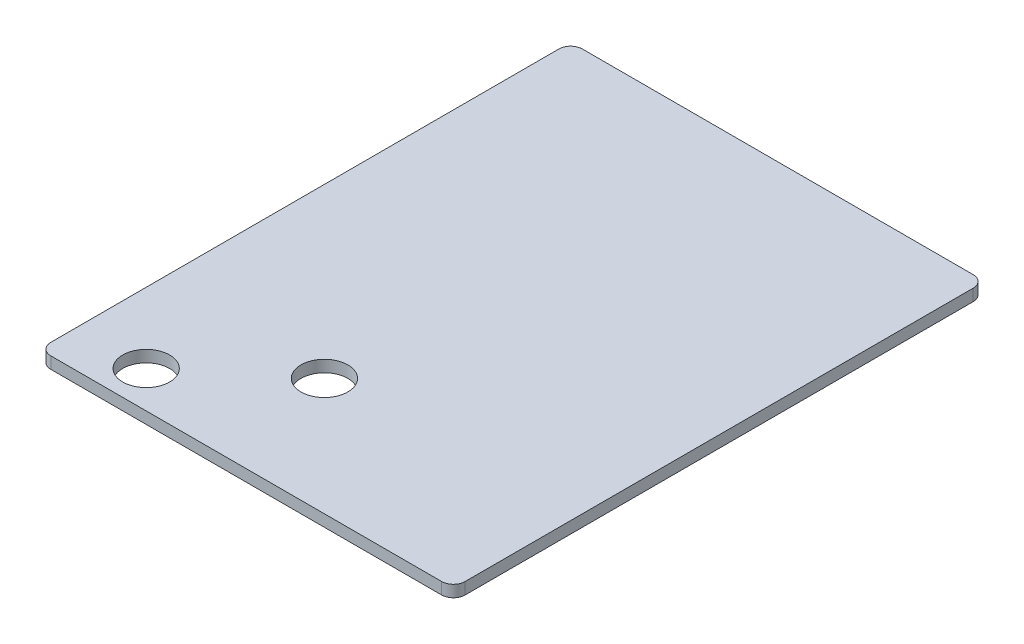
ISO-10303-21;
HEADER;
FILE_DESCRIPTION(('STEP AP214'),'2;1');
FILE_NAME('part.step','',(''),(''),'','','');
FILE_SCHEMA(('AUTOMOTIVE_DESIGN { 1 0 10303 214 1 1 1 1 }'));
ENDSEC;
DATA;
#1=APPLICATION_CONTEXT('core data for automotive mechanical design processes');
#2=APPLICATION_PROTOCOL_DEFINITION('international standard','automotive_design',2000,#1);
#3=PRODUCT_CONTEXT('',#1,'mechanical');
#4=PRODUCT('Part','Part','',(#3));
#5=PRODUCT_RELATED_PRODUCT_CATEGORY('part','',(#4));
#6=PRODUCT_DEFINITION_FORMATION('','',#4);
#7=PRODUCT_DEFINITION_CONTEXT('part definition',#1,'design');
#8=PRODUCT_DEFINITION('design','',#6,#7);
#9=PRODUCT_DEFINITION_SHAPE('','',#8);
#10=(LENGTH_UNIT() NAMED_UNIT(*) SI_UNIT(.MILLI.,.METRE.));
#11=(NAMED_UNIT(*) PLANE_ANGLE_UNIT() SI_UNIT($,.RADIAN.));
#12=(NAMED_UNIT(*) SI_UNIT($,.STERADIAN.) SOLID_ANGLE_UNIT());
#13=UNCERTAINTY_MEASURE_WITH_UNIT(LENGTH_MEASURE(1.E-05),#10,'distance_accuracy_value','');
#14=(GEOMETRIC_REPRESENTATION_CONTEXT(3) GLOBAL_UNCERTAINTY_ASSIGNED_CONTEXT((#13)) GLOBAL_UNIT_ASSIGNED_CONTEXT((#10,
#11,#12)) REPRESENTATION_CONTEXT('',''));
#15=CARTESIAN_POINT('',(0.,0.,0.));
#16=DIRECTION('',(0.,0.,1.));
#17=DIRECTION('',(1.,0.,0.));
#18=AXIS2_PLACEMENT_3D('',#15,#16,#17);
#19=CARTESIAN_POINT('',(53.,3.,68.));
#20=DIRECTION('',(-1.,0.,0.));
#21=DIRECTION('',(0.,0.,1.));
#22=AXIS2_PLACEMENT_3D('',#19,#20,#21);
#23=PLANE('',#22);
#24=DIRECTION('',(0.,0.,-1.));
#25=VECTOR('',#24,1.);
#26=CARTESIAN_POINT('',(53.,3.,68.));
#27=LINE('',#26,#25);
#28=CARTESIAN_POINT('',(53.,3.,65.));
#29=VERTEX_POINT('',#28);
#30=CARTESIAN_POINT('',(53.,3.,-65.));
#31=VERTEX_POINT('',#30);
#32=EDGE_CURVE('E127',#29,#31,#27,.T.);
#33=ORIENTED_EDGE('',*,*,#32,.F.);
#34=DIRECTION('',(0.,-1.,0.));
#35=VECTOR('',#34,1.);
#36=CARTESIAN_POINT('',(53.,3.,65.));
#37=LINE('',#36,#35);
#38=CARTESIAN_POINT('',(53.,0.,65.));
#39=VERTEX_POINT('',#38);
#40=EDGE_CURVE('E111',#29,#39,#37,.T.);
#41=ORIENTED_EDGE('',*,*,#40,.T.);
#42=DIRECTION('',(0.,0.,-1.));
#43=VECTOR('',#42,1.);
#44=CARTESIAN_POINT('',(53.,0.,68.));
#45=LINE('',#44,#43);
#46=CARTESIAN_POINT('',(53.,0.,-65.));
#47=VERTEX_POINT('',#46);
#48=EDGE_CURVE('E124',#39,#47,#45,.T.);
#49=ORIENTED_EDGE('',*,*,#48,.T.);
#50=DIRECTION('',(0.,-1.,0.));
#51=VECTOR('',#50,1.);
#52=CARTESIAN_POINT('',(53.,3.,-65.));
#53=LINE('',#52,#51);
#54=EDGE_CURVE('E130',#47,#31,#53,.F.);
#55=ORIENTED_EDGE('',*,*,#54,.T.);
#56=EDGE_LOOP('',(#33,#41,#49,#55));
#57=FACE_BOUND('',#56,.T.);
#58=ADVANCED_FACE('F38',(#57),#23,.F.);
#59=CARTESIAN_POINT('',(-53.,3.,-68.));
#60=DIRECTION('',(0.,0.,1.));
#61=DIRECTION('',(1.,0.,0.));
#62=AXIS2_PLACEMENT_3D('',#59,#60,#61);
#63=PLANE('',#62);
#64=DIRECTION('',(-1.,0.,0.));
#65=VECTOR('',#64,1.);
#66=CARTESIAN_POINT('',(-53.,3.,-68.));
#67=LINE('',#66,#65);
#68=CARTESIAN_POINT('',(50.,3.,-68.));
#69=VERTEX_POINT('',#68);
#70=CARTESIAN_POINT('',(-50.,3.,-68.));
#71=VERTEX_POINT('',#70);
#72=EDGE_CURVE('E203',#69,#71,#67,.T.);
#73=ORIENTED_EDGE('',*,*,#72,.F.);
#74=DIRECTION('',(0.,-1.,0.));
#75=VECTOR('',#74,1.);
#76=CARTESIAN_POINT('',(50.,3.,-68.));
#77=LINE('',#76,#75);
#78=CARTESIAN_POINT('',(50.,0.,-68.));
#79=VERTEX_POINT('',#78);
#80=EDGE_CURVE('E181',#69,#79,#77,.T.);
#81=ORIENTED_EDGE('',*,*,#80,.T.);
#82=DIRECTION('',(-1.,0.,0.));
#83=VECTOR('',#82,1.);
#84=CARTESIAN_POINT('',(-53.,0.,-68.));
#85=LINE('',#84,#83);
#86=CARTESIAN_POINT('',(-50.,0.,-68.));
#87=VERTEX_POINT('',#86);
#88=EDGE_CURVE('E135',#79,#87,#85,.T.);
#89=ORIENTED_EDGE('',*,*,#88,.T.);
#90=DIRECTION('',(0.,-1.,0.));
#91=VECTOR('',#90,1.);
#92=CARTESIAN_POINT('',(-50.,3.,-68.));
#93=LINE('',#92,#91);
#94=EDGE_CURVE('E178',#87,#71,#93,.F.);
#95=ORIENTED_EDGE('',*,*,#94,.T.);
#96=EDGE_LOOP('',(#73,#81,#89,#95));
#97=FACE_BOUND('',#96,.T.);
#98=ADVANCED_FACE('F224',(#97),#63,.F.);
#99=CARTESIAN_POINT('',(-53.,3.,68.));
#100=DIRECTION('',(1.,0.,0.));
#101=DIRECTION('',(0.,0.,-1.));
#102=AXIS2_PLACEMENT_3D('',#99,#100,#101);
#103=PLANE('',#102);
#104=DIRECTION('',(0.,0.,1.));
#105=VECTOR('',#104,1.);
#106=CARTESIAN_POINT('',(-53.,3.,68.));
#107=LINE('',#106,#105);
#108=CARTESIAN_POINT('',(-53.,3.,-65.));
#109=VERTEX_POINT('',#108);
#110=CARTESIAN_POINT('',(-53.,3.,65.));
#111=VERTEX_POINT('',#110);
#112=EDGE_CURVE('E205',#109,#111,#107,.T.);
#113=ORIENTED_EDGE('',*,*,#112,.F.);
#114=DIRECTION('',(0.,-1.,0.));
#115=VECTOR('',#114,1.);
#116=CARTESIAN_POINT('',(-53.,3.,-65.));
#117=LINE('',#116,#115);
#118=CARTESIAN_POINT('',(-53.,0.,-65.));
#119=VERTEX_POINT('',#118);
#120=EDGE_CURVE('E11',#109,#119,#117,.T.);
#121=ORIENTED_EDGE('',*,*,#120,.T.);
#122=DIRECTION('',(0.,0.,1.));
#123=VECTOR('',#122,1.);
#124=CARTESIAN_POINT('',(-53.,0.,68.));
#125=LINE('',#124,#123);
#126=CARTESIAN_POINT('',(-53.,0.,65.));
#127=VERTEX_POINT('',#126);
#128=EDGE_CURVE('E140',#119,#127,#125,.T.);
#129=ORIENTED_EDGE('',*,*,#128,.T.);
#130=DIRECTION('',(0.,-1.,0.));
#131=VECTOR('',#130,1.);
#132=CARTESIAN_POINT('',(-53.,3.,65.));
#133=LINE('',#132,#131);
#134=EDGE_CURVE('E48',#127,#111,#133,.F.);
#135=ORIENTED_EDGE('',*,*,#134,.T.);
#136=EDGE_LOOP('',(#113,#121,#129,#135));
#137=FACE_BOUND('',#136,.T.);
#138=ADVANCED_FACE('F217',(#137),#103,.F.);
#139=CARTESIAN_POINT('',(-53.,3.,68.));
#140=DIRECTION('',(0.,0.,-1.));
#141=DIRECTION('',(-1.,0.,0.));
#142=AXIS2_PLACEMENT_3D('',#139,#140,#141);
#143=PLANE('',#142);
#144=DIRECTION('',(1.,0.,0.));
#145=VECTOR('',#144,1.);
#146=CARTESIAN_POINT('',(-53.,0.,68.));
#147=LINE('',#146,#145);
#148=CARTESIAN_POINT('',(-50.,0.,68.));
#149=VERTEX_POINT('',#148);
#150=CARTESIAN_POINT('',(50.,0.,68.));
#151=VERTEX_POINT('',#150);
#152=EDGE_CURVE('E150',#149,#151,#147,.T.);
#153=ORIENTED_EDGE('',*,*,#152,.T.);
#154=DIRECTION('',(0.,-1.,0.));
#155=VECTOR('',#154,1.);
#156=CARTESIAN_POINT('',(50.,3.,68.));
#157=LINE('',#156,#155);
#158=CARTESIAN_POINT('',(50.,3.,68.));
#159=VERTEX_POINT('',#158);
#160=EDGE_CURVE('E112',#151,#159,#157,.F.);
#161=ORIENTED_EDGE('',*,*,#160,.T.);
#162=DIRECTION('',(1.,0.,0.));
#163=VECTOR('',#162,1.);
#164=CARTESIAN_POINT('',(-53.,3.,68.));
#165=LINE('',#164,#163);
#166=CARTESIAN_POINT('',(-50.,3.,68.));
#167=VERTEX_POINT('',#166);
#168=EDGE_CURVE('E145',#167,#159,#165,.T.);
#169=ORIENTED_EDGE('',*,*,#168,.F.);
#170=DIRECTION('',(0.,-1.,0.));
#171=VECTOR('',#170,1.);
#172=CARTESIAN_POINT('',(-50.,3.,68.));
#173=LINE('',#172,#171);
#174=EDGE_CURVE('E118',#167,#149,#173,.T.);
#175=ORIENTED_EDGE('',*,*,#174,.T.);
#176=EDGE_LOOP('',(#153,#161,#169,#175));
#177=FACE_BOUND('',#176,.T.);
#178=ADVANCED_FACE('F214',(#177),#143,.F.);
#179=CARTESIAN_POINT('',(0.,3.,0.));
#180=DIRECTION('',(0.,-1.,0.));
#181=DIRECTION('',(0.,0.,-1.));
#182=AXIS2_PLACEMENT_3D('',#179,#180,#181);
#183=PLANE('',#182);
#184=CARTESIAN_POINT('',(-35.,3.,58.6));
#185=DIRECTION('',(0.,1.,0.));
#186=DIRECTION('',(0.,0.,1.));
#187=AXIS2_PLACEMENT_3D('',#184,#185,#186);
#188=CIRCLE('',#187,6.);
#189=CARTESIAN_POINT('',(-35.,3.,64.6));
#190=VERTEX_POINT('',#189);
#191=EDGE_CURVE('E188',#190,#190,#188,.T.);
#192=ORIENTED_EDGE('',*,*,#191,.F.);
#193=EDGE_LOOP('',(#192));
#194=FACE_BOUND('',#193,.T.);
#195=CARTESIAN_POINT('',(-10.,3.,38.));
#196=DIRECTION('',(0.,1.,0.));
#197=DIRECTION('',(0.,0.,1.));
#198=AXIS2_PLACEMENT_3D('',#195,#196,#197);
#199=CIRCLE('',#198,6.);
#200=CARTESIAN_POINT('',(-10.,3.,44.));
#201=VERTEX_POINT('',#200);
#202=EDGE_CURVE('E193',#201,#201,#199,.T.);
#203=ORIENTED_EDGE('',*,*,#202,.F.);
#204=EDGE_LOOP('',(#203));
#205=FACE_BOUND('',#204,.T.);
#206=ORIENTED_EDGE('',*,*,#168,.T.);
#207=CARTESIAN_POINT('',(50.,3.,65.));
#208=DIRECTION('',(0.,-1.,0.));
#209=DIRECTION('',(0.,0.,-1.));
#210=AXIS2_PLACEMENT_3D('',#207,#208,#209);
#211=CIRCLE('',#210,3.);
#212=EDGE_CURVE('E175',#159,#29,#211,.F.);
#213=ORIENTED_EDGE('',*,*,#212,.T.);
#214=ORIENTED_EDGE('',*,*,#32,.T.);
#215=CARTESIAN_POINT('',(50.,3.,-65.));
#216=DIRECTION('',(0.,-1.,0.));
#217=DIRECTION('',(0.,0.,-1.));
#218=AXIS2_PLACEMENT_3D('',#215,#216,#217);
#219=CIRCLE('',#218,3.);
#220=EDGE_CURVE('E172',#31,#69,#219,.F.);
#221=ORIENTED_EDGE('',*,*,#220,.T.);
#222=ORIENTED_EDGE('',*,*,#72,.T.);
#223=CARTESIAN_POINT('',(-50.,3.,-65.));
#224=DIRECTION('',(0.,-1.,0.));
#225=DIRECTION('',(0.,0.,-1.));
#226=AXIS2_PLACEMENT_3D('',#223,#224,#225);
#227=CIRCLE('',#226,3.);
#228=EDGE_CURVE('E62',#71,#109,#227,.F.);
#229=ORIENTED_EDGE('',*,*,#228,.T.);
#230=ORIENTED_EDGE('',*,*,#112,.T.);
#231=CARTESIAN_POINT('',(-50.,3.,65.));
#232=DIRECTION('',(0.,-1.,0.));
#233=DIRECTION('',(0.,0.,-1.));
#234=AXIS2_PLACEMENT_3D('',#231,#232,#233);
#235=CIRCLE('',#234,3.);
#236=EDGE_CURVE('E167',#111,#167,#235,.F.);
#237=ORIENTED_EDGE('',*,*,#236,.T.);
#238=EDGE_LOOP('',(#206,#213,#214,#221,#222,#229,#230,#237));
#239=FACE_BOUND('',#238,.T.);
#240=ADVANCED_FACE('F211',(#194,#205,#239),#183,.F.);
#241=CARTESIAN_POINT('',(0.,0.,0.));
#242=DIRECTION('',(0.,-1.,0.));
#243=DIRECTION('',(0.,0.,-1.));
#244=AXIS2_PLACEMENT_3D('',#241,#242,#243);
#245=PLANE('',#244);
#246=CARTESIAN_POINT('',(-35.,0.,58.6));
#247=DIRECTION('',(0.,-1.,0.));
#248=DIRECTION('',(0.,0.,-1.));
#249=AXIS2_PLACEMENT_3D('',#246,#247,#248);
#250=CIRCLE('',#249,6.);
#251=CARTESIAN_POINT('',(-35.,0.,52.6));
#252=VERTEX_POINT('',#251);
#253=EDGE_CURVE('E42',#252,#252,#250,.T.);
#254=ORIENTED_EDGE('',*,*,#253,.F.);
#255=EDGE_LOOP('',(#254));
#256=FACE_BOUND('',#255,.T.);
#257=CARTESIAN_POINT('',(-10.,0.,38.));
#258=DIRECTION('',(0.,-1.,0.));
#259=DIRECTION('',(0.,0.,-1.));
#260=AXIS2_PLACEMENT_3D('',#257,#258,#259);
#261=CIRCLE('',#260,6.);
#262=CARTESIAN_POINT('',(-10.,0.,32.));
#263=VERTEX_POINT('',#262);
#264=EDGE_CURVE('E143',#263,#263,#261,.T.);
#265=ORIENTED_EDGE('',*,*,#264,.F.);
#266=EDGE_LOOP('',(#265));
#267=FACE_BOUND('',#266,.T.);
#268=ORIENTED_EDGE('',*,*,#48,.F.);
#269=CARTESIAN_POINT('',(50.,0.,65.));
#270=DIRECTION('',(0.,-1.,0.));
#271=DIRECTION('',(0.,0.,-1.));
#272=AXIS2_PLACEMENT_3D('',#269,#270,#271);
#273=CIRCLE('',#272,3.);
#274=EDGE_CURVE('E107',#39,#151,#273,.T.);
#275=ORIENTED_EDGE('',*,*,#274,.T.);
#276=ORIENTED_EDGE('',*,*,#152,.F.);
#277=CARTESIAN_POINT('',(-50.,0.,65.));
#278=DIRECTION('',(0.,-1.,0.));
#279=DIRECTION('',(0.,0.,-1.));
#280=AXIS2_PLACEMENT_3D('',#277,#278,#279);
#281=CIRCLE('',#280,3.);
#282=EDGE_CURVE('E129',#149,#127,#281,.T.);
#283=ORIENTED_EDGE('',*,*,#282,.T.);
#284=ORIENTED_EDGE('',*,*,#128,.F.);
#285=CARTESIAN_POINT('',(-50.,0.,-65.));
#286=DIRECTION('',(0.,-1.,0.));
#287=DIRECTION('',(0.,0.,-1.));
#288=AXIS2_PLACEMENT_3D('',#285,#286,#287);
#289=CIRCLE('',#288,3.);
#290=EDGE_CURVE('E157',#119,#87,#289,.T.);
#291=ORIENTED_EDGE('',*,*,#290,.T.);
#292=ORIENTED_EDGE('',*,*,#88,.F.);
#293=CARTESIAN_POINT('',(50.,0.,-65.));
#294=DIRECTION('',(0.,-1.,0.));
#295=DIRECTION('',(0.,0.,-1.));
#296=AXIS2_PLACEMENT_3D('',#293,#294,#295);
#297=CIRCLE('',#296,3.);
#298=EDGE_CURVE('E119',#79,#47,#297,.T.);
#299=ORIENTED_EDGE('',*,*,#298,.T.);
#300=EDGE_LOOP('',(#268,#275,#276,#283,#284,#291,#292,#299));
#301=FACE_BOUND('',#300,.T.);
#302=ADVANCED_FACE('F132',(#256,#267,#301),#245,.T.);
#303=CARTESIAN_POINT('',(50.,3.,65.));
#304=DIRECTION('',(0.,-1.,0.));
#305=DIRECTION('',(0.,0.,-1.));
#306=AXIS2_PLACEMENT_3D('',#303,#304,#305);
#307=CYLINDRICAL_SURFACE('',#306,3.);
#308=ORIENTED_EDGE('',*,*,#212,.F.);
#309=ORIENTED_EDGE('',*,*,#160,.F.);
#310=ORIENTED_EDGE('',*,*,#274,.F.);
#311=ORIENTED_EDGE('',*,*,#40,.F.);
#312=EDGE_LOOP('',(#308,#309,#310,#311));
#313=FACE_BOUND('',#312,.T.);
#314=ADVANCED_FACE('F110',(#313),#307,.T.);
#315=CARTESIAN_POINT('',(50.,3.,-65.));
#316=DIRECTION('',(0.,-1.,0.));
#317=DIRECTION('',(0.,0.,-1.));
#318=AXIS2_PLACEMENT_3D('',#315,#316,#317);
#319=CYLINDRICAL_SURFACE('',#318,3.);
#320=ORIENTED_EDGE('',*,*,#220,.F.);
#321=ORIENTED_EDGE('',*,*,#54,.F.);
#322=ORIENTED_EDGE('',*,*,#298,.F.);
#323=ORIENTED_EDGE('',*,*,#80,.F.);
#324=EDGE_LOOP('',(#320,#321,#322,#323));
#325=FACE_BOUND('',#324,.T.);
#326=ADVANCED_FACE('F228',(#325),#319,.T.);
#327=CARTESIAN_POINT('',(-50.,3.,-65.));
#328=DIRECTION('',(0.,-1.,0.));
#329=DIRECTION('',(0.,0.,-1.));
#330=AXIS2_PLACEMENT_3D('',#327,#328,#329);
#331=CYLINDRICAL_SURFACE('',#330,3.);
#332=ORIENTED_EDGE('',*,*,#228,.F.);
#333=ORIENTED_EDGE('',*,*,#94,.F.);
#334=ORIENTED_EDGE('',*,*,#290,.F.);
#335=ORIENTED_EDGE('',*,*,#120,.F.);
#336=EDGE_LOOP('',(#332,#333,#334,#335));
#337=FACE_BOUND('',#336,.T.);
#338=ADVANCED_FACE('F220',(#337),#331,.T.);
#339=CARTESIAN_POINT('',(-50.,3.,65.));
#340=DIRECTION('',(0.,-1.,0.));
#341=DIRECTION('',(0.,0.,-1.));
#342=AXIS2_PLACEMENT_3D('',#339,#340,#341);
#343=CYLINDRICAL_SURFACE('',#342,3.);
#344=ORIENTED_EDGE('',*,*,#236,.F.);
#345=ORIENTED_EDGE('',*,*,#134,.F.);
#346=ORIENTED_EDGE('',*,*,#282,.F.);
#347=ORIENTED_EDGE('',*,*,#174,.F.);
#348=EDGE_LOOP('',(#344,#345,#346,#347));
#349=FACE_BOUND('',#348,.T.);
#350=ADVANCED_FACE('F40',(#349),#343,.T.);
#351=CARTESIAN_POINT('',(-10.,-7.,38.));
#352=DIRECTION('',(0.,1.,0.));
#353=DIRECTION('',(0.,0.,1.));
#354=AXIS2_PLACEMENT_3D('',#351,#352,#353);
#355=CYLINDRICAL_SURFACE('',#354,6.);
#356=ORIENTED_EDGE('',*,*,#264,.T.);
#357=EDGE_LOOP('',(#356));
#358=FACE_BOUND('',#357,.T.);
#359=ORIENTED_EDGE('',*,*,#202,.T.);
#360=EDGE_LOOP('',(#359));
#361=FACE_BOUND('',#360,.T.);
#362=ADVANCED_FACE('F253',(#358,#361),#355,.F.);
#363=CARTESIAN_POINT('',(-35.,-7.,58.6));
#364=DIRECTION('',(0.,1.,0.));
#365=DIRECTION('',(0.,0.,1.));
#366=AXIS2_PLACEMENT_3D('',#363,#364,#365);
#367=CYLINDRICAL_SURFACE('',#366,6.);
#368=ORIENTED_EDGE('',*,*,#253,.T.);
#369=EDGE_LOOP('',(#368));
#370=FACE_BOUND('',#369,.T.);
#371=ORIENTED_EDGE('',*,*,#191,.T.);
#372=EDGE_LOOP('',(#371));
#373=FACE_BOUND('',#372,.T.);
#374=ADVANCED_FACE('F256',(#370,#373),#367,.F.);
#375=CLOSED_SHELL('',(#58,#98,#138,#178,#240,#302,#314,#326,#338,#350,#362,#374));
#376=MANIFOLD_SOLID_BREP('B2',#375);
#377=ADVANCED_BREP_SHAPE_REPRESENTATION('',(#18,#376),#14);
#378=SHAPE_DEFINITION_REPRESENTATION(#9,#377);
ENDSEC;
END-ISO-10303-21;
